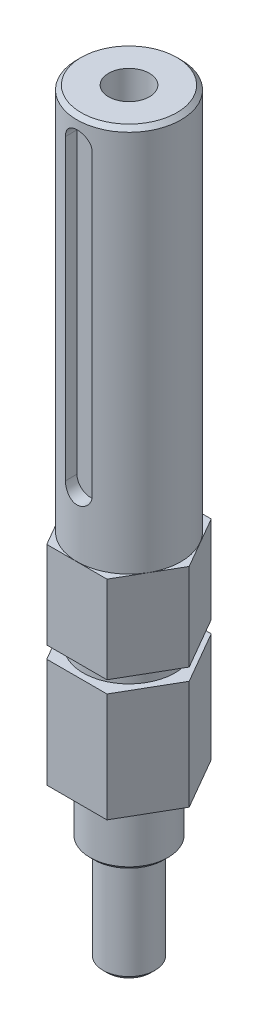
ISO-10303-21;
HEADER;
FILE_DESCRIPTION(('STEP AP214'),'2;1');
FILE_NAME('part.step','',(''),(''),'','','');
FILE_SCHEMA(('AUTOMOTIVE_DESIGN { 1 0 10303 214 1 1 1 1 }'));
ENDSEC;
DATA;
#1=APPLICATION_CONTEXT('core data for automotive mechanical design processes');
#2=APPLICATION_PROTOCOL_DEFINITION('international standard','automotive_design',2000,#1);
#3=PRODUCT_CONTEXT('',#1,'mechanical');
#4=PRODUCT('Part','Part','',(#3));
#5=PRODUCT_RELATED_PRODUCT_CATEGORY('part','',(#4));
#6=PRODUCT_DEFINITION_FORMATION('','',#4);
#7=PRODUCT_DEFINITION_CONTEXT('part definition',#1,'design');
#8=PRODUCT_DEFINITION('design','',#6,#7);
#9=PRODUCT_DEFINITION_SHAPE('','',#8);
#10=(LENGTH_UNIT() NAMED_UNIT(*) SI_UNIT(.MILLI.,.METRE.));
#11=(NAMED_UNIT(*) PLANE_ANGLE_UNIT() SI_UNIT($,.RADIAN.));
#12=(NAMED_UNIT(*) SI_UNIT($,.STERADIAN.) SOLID_ANGLE_UNIT());
#13=UNCERTAINTY_MEASURE_WITH_UNIT(LENGTH_MEASURE(1.E-05),#10,'distance_accuracy_value','');
#14=(GEOMETRIC_REPRESENTATION_CONTEXT(3) GLOBAL_UNCERTAINTY_ASSIGNED_CONTEXT((#13)) GLOBAL_UNIT_ASSIGNED_CONTEXT((#10,
#11,#12)) REPRESENTATION_CONTEXT('',''));
#15=CARTESIAN_POINT('',(0.,0.,0.));
#16=DIRECTION('',(0.,0.,1.));
#17=DIRECTION('',(1.,0.,0.));
#18=AXIS2_PLACEMENT_3D('',#15,#16,#17);
#19=CARTESIAN_POINT('',(-35.1448337161431,-45.212,-16.669011646302));
#20=DIRECTION('',(0.,-1.,0.));
#21=DIRECTION('',(0.,0.,-1.));
#22=AXIS2_PLACEMENT_3D('',#19,#20,#21);
#23=PLANE('',#22);
#24=CARTESIAN_POINT('',(-38.3071337161431,-45.2119999999923,-16.669011646302));
#25=DIRECTION('',(0.,1.,0.));
#26=DIRECTION('',(0.,0.,1.));
#27=AXIS2_PLACEMENT_3D('',#24,#25,#26);
#28=CIRCLE('',#27,2.65430000003345);
#29=CARTESIAN_POINT('',(-38.3071337161431,-45.2119999999923,-14.0147116462686));
#30=VERTEX_POINT('',#29);
#31=EDGE_CURVE('E19',#30,#30,#28,.T.);
#32=ORIENTED_EDGE('',*,*,#31,.F.);
#33=EDGE_LOOP('',(#32));
#34=FACE_BOUND('',#33,.T.);
#35=ADVANCED_FACE('F16',(#34),#23,.T.);
#36=CARTESIAN_POINT('',(-38.3071337161431,-44.704000000138,-16.669011646302));
#37=DIRECTION('',(0.,1.,0.));
#38=DIRECTION('',(0.,0.,1.));
#39=AXIS2_PLACEMENT_3D('',#36,#37,#38);
#40=CONICAL_SURFACE('',#39,3.16229999994458,0.785398163453397);
#41=ORIENTED_EDGE('',*,*,#31,.T.);
#42=EDGE_LOOP('',(#41));
#43=FACE_BOUND('',#42,.T.);
#44=CARTESIAN_POINT('',(-38.3071337161431,-44.704,-16.669011646302));
#45=DIRECTION('',(0.,1.,0.));
#46=DIRECTION('',(0.,0.,1.));
#47=AXIS2_PLACEMENT_3D('',#44,#45,#46);
#48=CIRCLE('',#47,3.1623);
#49=CARTESIAN_POINT('',(-38.3071337161431,-44.704,-13.506711646302));
#50=VERTEX_POINT('',#49);
#51=EDGE_CURVE('E175',#50,#50,#48,.T.);
#52=ORIENTED_EDGE('',*,*,#51,.F.);
#53=EDGE_LOOP('',(#52));
#54=FACE_BOUND('',#53,.T.);
#55=ADVANCED_FACE('F375',(#43,#54),#40,.T.);
#56=CARTESIAN_POINT('',(-38.3071337161431,-45.212,-16.669011646302));
#57=DIRECTION('',(0.,1.,0.));
#58=DIRECTION('',(0.,0.,1.));
#59=AXIS2_PLACEMENT_3D('',#56,#57,#58);
#60=CYLINDRICAL_SURFACE('',#59,3.1623);
#61=ORIENTED_EDGE('',*,*,#51,.T.);
#62=EDGE_LOOP('',(#61));
#63=FACE_BOUND('',#62,.T.);
#64=CARTESIAN_POINT('',(-38.3071337161431,-32.512,-16.669011646302));
#65=DIRECTION('',(0.,1.,0.));
#66=DIRECTION('',(0.,0.,1.));
#67=AXIS2_PLACEMENT_3D('',#64,#65,#66);
#68=CIRCLE('',#67,3.1623);
#69=CARTESIAN_POINT('',(-38.3071337161431,-32.512,-13.506711646302));
#70=VERTEX_POINT('',#69);
#71=EDGE_CURVE('E177',#70,#70,#68,.T.);
#72=ORIENTED_EDGE('',*,*,#71,.F.);
#73=EDGE_LOOP('',(#72));
#74=FACE_BOUND('',#73,.T.);
#75=ADVANCED_FACE('F372',(#63,#74),#60,.T.);
#76=CARTESIAN_POINT('',(-33.5573337161431,-32.512,-16.669011646302));
#77=DIRECTION('',(0.,-1.,0.));
#78=DIRECTION('',(0.,0.,-1.));
#79=AXIS2_PLACEMENT_3D('',#76,#77,#78);
#80=PLANE('',#79);
#81=ORIENTED_EDGE('',*,*,#71,.T.);
#82=EDGE_LOOP('',(#81));
#83=FACE_BOUND('',#82,.T.);
#84=CARTESIAN_POINT('',(-38.3071337161431,-32.5119999999401,-16.669011646302));
#85=DIRECTION('',(0.,1.,0.));
#86=DIRECTION('',(0.,0.,1.));
#87=AXIS2_PLACEMENT_3D('',#84,#85,#86);
#88=CIRCLE('',#87,4.24180000006128);
#89=CARTESIAN_POINT('',(-38.3071337161431,-32.5119999999401,-12.4272116462407));
#90=VERTEX_POINT('',#89);
#91=EDGE_CURVE('E174',#90,#90,#88,.T.);
#92=ORIENTED_EDGE('',*,*,#91,.F.);
#93=EDGE_LOOP('',(#92));
#94=FACE_BOUND('',#93,.T.);
#95=ADVANCED_FACE('F368',(#83,#94),#80,.T.);
#96=CARTESIAN_POINT('',(-38.3071337161431,-32.0040000000859,-16.669011646302));
#97=DIRECTION('',(0.,1.,0.));
#98=DIRECTION('',(0.,0.,1.));
#99=AXIS2_PLACEMENT_3D('',#96,#97,#98);
#100=CONICAL_SURFACE('',#99,4.74979999991557,0.785398163397448);
#101=CARTESIAN_POINT('',(-38.3071337161431,-32.004,-16.669011646302));
#102=DIRECTION('',(0.,1.,0.));
#103=DIRECTION('',(0.,0.,1.));
#104=AXIS2_PLACEMENT_3D('',#101,#102,#103);
#105=CIRCLE('',#104,4.7498);
#106=CARTESIAN_POINT('',(-38.3071337161431,-32.004,-11.919211646302));
#107=VERTEX_POINT('',#106);
#108=EDGE_CURVE('E171',#107,#107,#105,.T.);
#109=ORIENTED_EDGE('',*,*,#108,.F.);
#110=EDGE_LOOP('',(#109));
#111=FACE_BOUND('',#110,.T.);
#112=ORIENTED_EDGE('',*,*,#91,.T.);
#113=EDGE_LOOP('',(#112));
#114=FACE_BOUND('',#113,.T.);
#115=ADVANCED_FACE('F364',(#111,#114),#100,.T.);
#116=CARTESIAN_POINT('',(-38.3071337161431,-45.212,-16.669011646302));
#117=DIRECTION('',(0.,1.,0.));
#118=DIRECTION('',(0.,0.,1.));
#119=AXIS2_PLACEMENT_3D('',#116,#117,#118);
#120=CYLINDRICAL_SURFACE('',#119,4.7498);
#121=CARTESIAN_POINT('',(-38.3071337161431,-25.4,-16.669011646302));
#122=DIRECTION('',(0.,1.,0.));
#123=DIRECTION('',(0.,0.,1.));
#124=AXIS2_PLACEMENT_3D('',#121,#122,#123);
#125=CIRCLE('',#124,4.7498);
#126=CARTESIAN_POINT('',(-38.3071337161431,-25.4,-11.919211646302));
#127=VERTEX_POINT('',#126);
#128=EDGE_CURVE('E153',#127,#127,#125,.T.);
#129=ORIENTED_EDGE('',*,*,#128,.F.);
#130=EDGE_LOOP('',(#129));
#131=FACE_BOUND('',#130,.T.);
#132=ORIENTED_EDGE('',*,*,#108,.T.);
#133=EDGE_LOOP('',(#132));
#134=FACE_BOUND('',#133,.T.);
#135=ADVANCED_FACE('F361',(#131,#134),#120,.T.);
#136=CARTESIAN_POINT('',(-41.9733079254973,-25.4,-10.319011646302));
#137=DIRECTION('',(0.,-1.,0.));
#138=DIRECTION('',(0.,0.,-1.));
#139=AXIS2_PLACEMENT_3D('',#136,#137,#138);
#140=PLANE('',#139);
#141=DIRECTION('',(-0.5,0.,-0.866025403784439));
#142=VECTOR('',#141,1.);
#143=CARTESIAN_POINT('',(-34.640959506789,-25.4,-23.019011646302));
#144=LINE('',#143,#142);
#145=CARTESIAN_POINT('',(-30.9747852974349,-25.4,-16.669011646302));
#146=VERTEX_POINT('',#145);
#147=CARTESIAN_POINT('',(-34.640959506789,-25.4,-23.019011646302));
#148=VERTEX_POINT('',#147);
#149=EDGE_CURVE('E313',#146,#148,#144,.T.);
#150=ORIENTED_EDGE('',*,*,#149,.F.);
#151=DIRECTION('',(0.500000000000001,0.,-0.866025403784438));
#152=VECTOR('',#151,1.);
#153=CARTESIAN_POINT('',(-30.9747852974349,-25.4,-16.669011646302));
#154=LINE('',#153,#152);
#155=CARTESIAN_POINT('',(-34.640959506789,-25.4,-10.319011646302));
#156=VERTEX_POINT('',#155);
#157=EDGE_CURVE('E307',#156,#146,#154,.T.);
#158=ORIENTED_EDGE('',*,*,#157,.F.);
#159=DIRECTION('',(1.,0.,0.));
#160=VECTOR('',#159,1.);
#161=CARTESIAN_POINT('',(-34.640959506789,-25.4,-10.319011646302));
#162=LINE('',#161,#160);
#163=CARTESIAN_POINT('',(-41.9733079254973,-25.4,-10.319011646302));
#164=VERTEX_POINT('',#163);
#165=EDGE_CURVE('E150',#164,#156,#162,.T.);
#166=ORIENTED_EDGE('',*,*,#165,.F.);
#167=DIRECTION('',(0.5,0.,0.866025403784439));
#168=VECTOR('',#167,1.);
#169=CARTESIAN_POINT('',(-41.9733079254973,-25.4,-10.319011646302));
#170=LINE('',#169,#168);
#171=CARTESIAN_POINT('',(-45.6394821348514,-25.4,-16.669011646302));
#172=VERTEX_POINT('',#171);
#173=EDGE_CURVE('E145',#172,#164,#170,.T.);
#174=ORIENTED_EDGE('',*,*,#173,.F.);
#175=DIRECTION('',(-0.5,0.,0.866025403784439));
#176=VECTOR('',#175,1.);
#177=CARTESIAN_POINT('',(-45.6394821348514,-25.4,-16.669011646302));
#178=LINE('',#177,#176);
#179=CARTESIAN_POINT('',(-41.9733079254973,-25.4,-23.019011646302));
#180=VERTEX_POINT('',#179);
#181=EDGE_CURVE('E142',#180,#172,#178,.T.);
#182=ORIENTED_EDGE('',*,*,#181,.F.);
#183=DIRECTION('',(-1.,0.,0.));
#184=VECTOR('',#183,1.);
#185=CARTESIAN_POINT('',(-41.9733079254973,-25.4,-23.019011646302));
#186=LINE('',#185,#184);
#187=EDGE_CURVE('E162',#148,#180,#186,.T.);
#188=ORIENTED_EDGE('',*,*,#187,.F.);
#189=EDGE_LOOP('',(#150,#158,#166,#174,#182,#188));
#190=FACE_BOUND('',#189,.T.);
#191=ORIENTED_EDGE('',*,*,#128,.T.);
#192=EDGE_LOOP('',(#191));
#193=FACE_BOUND('',#192,.T.);
#194=ADVANCED_FACE('F147',(#190,#193),#140,.T.);
#195=CARTESIAN_POINT('',(-41.9733079254973,-12.1158,-10.319011646302));
#196=DIRECTION('',(-0.866025403784439,0.,0.5));
#197=DIRECTION('',(0.5,0.,0.866025403784439));
#198=AXIS2_PLACEMENT_3D('',#195,#196,#197);
#199=PLANE('',#198);
#200=DIRECTION('',(-0.5,0.,-0.866025403784438));
#201=VECTOR('',#200,1.);
#202=CARTESIAN_POINT('',(-41.9733079254973,-12.1158,-10.319011646302));
#203=LINE('',#202,#201);
#204=CARTESIAN_POINT('',(-41.9733079254973,-12.1158,-10.319011646302));
#205=VERTEX_POINT('',#204);
#206=CARTESIAN_POINT('',(-45.6394821348514,-12.1158,-16.669011646302));
#207=VERTEX_POINT('',#206);
#208=EDGE_CURVE('E159',#205,#207,#203,.T.);
#209=ORIENTED_EDGE('',*,*,#208,.T.);
#210=DIRECTION('',(0.,1.,0.));
#211=VECTOR('',#210,1.);
#212=CARTESIAN_POINT('',(-45.6394821348514,-12.1158,-16.669011646302));
#213=LINE('',#212,#211);
#214=EDGE_CURVE('E156',#172,#207,#213,.T.);
#215=ORIENTED_EDGE('',*,*,#214,.F.);
#216=ORIENTED_EDGE('',*,*,#173,.T.);
#217=DIRECTION('',(0.,1.,0.));
#218=VECTOR('',#217,1.);
#219=CARTESIAN_POINT('',(-41.9733079254973,-12.1158,-10.319011646302));
#220=LINE('',#219,#218);
#221=EDGE_CURVE('E298',#205,#164,#220,.F.);
#222=ORIENTED_EDGE('',*,*,#221,.F.);
#223=EDGE_LOOP('',(#209,#215,#216,#222));
#224=FACE_BOUND('',#223,.T.);
#225=ADVANCED_FACE('F157',(#224),#199,.T.);
#226=CARTESIAN_POINT('',(-45.6394821348514,-12.1158,-16.669011646302));
#227=DIRECTION('',(-0.866025403784439,0.,-0.5));
#228=DIRECTION('',(-0.5,0.,0.866025403784439));
#229=AXIS2_PLACEMENT_3D('',#226,#227,#228);
#230=PLANE('',#229);
#231=DIRECTION('',(0.5,0.,-0.866025403784438));
#232=VECTOR('',#231,1.);
#233=CARTESIAN_POINT('',(-45.6394821348514,-12.1158,-16.669011646302));
#234=LINE('',#233,#232);
#235=CARTESIAN_POINT('',(-41.9733079254973,-12.1158,-23.019011646302));
#236=VERTEX_POINT('',#235);
#237=EDGE_CURVE('E295',#207,#236,#234,.T.);
#238=ORIENTED_EDGE('',*,*,#237,.T.);
#239=DIRECTION('',(0.,1.,0.));
#240=VECTOR('',#239,1.);
#241=CARTESIAN_POINT('',(-41.9733079254973,-12.1158,-23.019011646302));
#242=LINE('',#241,#240);
#243=EDGE_CURVE('E166',#180,#236,#242,.T.);
#244=ORIENTED_EDGE('',*,*,#243,.F.);
#245=ORIENTED_EDGE('',*,*,#181,.T.);
#246=ORIENTED_EDGE('',*,*,#214,.T.);
#247=EDGE_LOOP('',(#238,#244,#245,#246));
#248=FACE_BOUND('',#247,.T.);
#249=ADVANCED_FACE('F164',(#248),#230,.T.);
#250=CARTESIAN_POINT('',(-41.9733079254973,-12.1158,-23.019011646302));
#251=DIRECTION('',(0.,0.,-1.));
#252=DIRECTION('',(-1.,0.,0.));
#253=AXIS2_PLACEMENT_3D('',#250,#251,#252);
#254=PLANE('',#253);
#255=DIRECTION('',(1.,0.,0.));
#256=VECTOR('',#255,1.);
#257=CARTESIAN_POINT('',(-41.9733079254973,-12.1158,-23.019011646302));
#258=LINE('',#257,#256);
#259=CARTESIAN_POINT('',(-34.640959506789,-12.1158,-23.019011646302));
#260=VERTEX_POINT('',#259);
#261=EDGE_CURVE('E293',#236,#260,#258,.T.);
#262=ORIENTED_EDGE('',*,*,#261,.T.);
#263=DIRECTION('',(0.,1.,0.));
#264=VECTOR('',#263,1.);
#265=CARTESIAN_POINT('',(-34.640959506789,-12.1158,-23.019011646302));
#266=LINE('',#265,#264);
#267=EDGE_CURVE('E310',#148,#260,#266,.T.);
#268=ORIENTED_EDGE('',*,*,#267,.F.);
#269=ORIENTED_EDGE('',*,*,#187,.T.);
#270=ORIENTED_EDGE('',*,*,#243,.T.);
#271=EDGE_LOOP('',(#262,#268,#269,#270));
#272=FACE_BOUND('',#271,.T.);
#273=ADVANCED_FACE('F318',(#272),#254,.T.);
#274=CARTESIAN_POINT('',(-34.640959506789,-12.1158,-23.019011646302));
#275=DIRECTION('',(0.866025403784439,0.,-0.5));
#276=DIRECTION('',(-0.5,0.,-0.866025403784439));
#277=AXIS2_PLACEMENT_3D('',#274,#275,#276);
#278=PLANE('',#277);
#279=DIRECTION('',(0.5,0.,0.866025403784438));
#280=VECTOR('',#279,1.);
#281=CARTESIAN_POINT('',(-34.640959506789,-12.1158,-23.019011646302));
#282=LINE('',#281,#280);
#283=CARTESIAN_POINT('',(-30.9747852974349,-12.1158,-16.669011646302));
#284=VERTEX_POINT('',#283);
#285=EDGE_CURVE('E291',#260,#284,#282,.T.);
#286=ORIENTED_EDGE('',*,*,#285,.T.);
#287=DIRECTION('',(0.,1.,0.));
#288=VECTOR('',#287,1.);
#289=CARTESIAN_POINT('',(-30.9747852974349,-12.1158,-16.669011646302));
#290=LINE('',#289,#288);
#291=EDGE_CURVE('E304',#146,#284,#290,.T.);
#292=ORIENTED_EDGE('',*,*,#291,.F.);
#293=ORIENTED_EDGE('',*,*,#149,.T.);
#294=ORIENTED_EDGE('',*,*,#267,.T.);
#295=EDGE_LOOP('',(#286,#292,#293,#294));
#296=FACE_BOUND('',#295,.T.);
#297=ADVANCED_FACE('F323',(#296),#278,.T.);
#298=CARTESIAN_POINT('',(-30.9747852974349,-12.1158,-16.669011646302));
#299=DIRECTION('',(0.866025403784438,0.,0.500000000000001));
#300=DIRECTION('',(0.500000000000001,0.,-0.866025403784438));
#301=AXIS2_PLACEMENT_3D('',#298,#299,#300);
#302=PLANE('',#301);
#303=DIRECTION('',(-0.500000000000001,0.,0.866025403784438));
#304=VECTOR('',#303,1.);
#305=CARTESIAN_POINT('',(-30.9747852974349,-12.1158,-16.669011646302));
#306=LINE('',#305,#304);
#307=CARTESIAN_POINT('',(-34.640959506789,-12.1158,-10.319011646302));
#308=VERTEX_POINT('',#307);
#309=EDGE_CURVE('E289',#284,#308,#306,.T.);
#310=ORIENTED_EDGE('',*,*,#309,.T.);
#311=DIRECTION('',(0.,1.,0.));
#312=VECTOR('',#311,1.);
#313=CARTESIAN_POINT('',(-34.640959506789,-12.1158,-10.319011646302));
#314=LINE('',#313,#312);
#315=EDGE_CURVE('E300',#156,#308,#314,.T.);
#316=ORIENTED_EDGE('',*,*,#315,.F.);
#317=ORIENTED_EDGE('',*,*,#157,.T.);
#318=ORIENTED_EDGE('',*,*,#291,.T.);
#319=EDGE_LOOP('',(#310,#316,#317,#318));
#320=FACE_BOUND('',#319,.T.);
#321=ADVANCED_FACE('F327',(#320),#302,.T.);
#322=CARTESIAN_POINT('',(-34.640959506789,-12.1158,-10.319011646302));
#323=DIRECTION('',(0.,0.,1.));
#324=DIRECTION('',(1.,0.,0.));
#325=AXIS2_PLACEMENT_3D('',#322,#323,#324);
#326=PLANE('',#325);
#327=DIRECTION('',(1.,0.,0.));
#328=VECTOR('',#327,1.);
#329=CARTESIAN_POINT('',(-41.9733079254973,-12.1158,-10.319011646302));
#330=LINE('',#329,#328);
#331=EDGE_CURVE('E286',#308,#205,#330,.F.);
#332=ORIENTED_EDGE('',*,*,#331,.T.);
#333=ORIENTED_EDGE('',*,*,#221,.T.);
#334=ORIENTED_EDGE('',*,*,#165,.T.);
#335=ORIENTED_EDGE('',*,*,#315,.T.);
#336=EDGE_LOOP('',(#332,#333,#334,#335));
#337=FACE_BOUND('',#336,.T.);
#338=ADVANCED_FACE('F330',(#337),#326,.T.);
#339=CARTESIAN_POINT('',(-41.9733079254973,-12.1158,-10.319011646302));
#340=DIRECTION('',(0.,-1.,0.));
#341=DIRECTION('',(0.,0.,-1.));
#342=AXIS2_PLACEMENT_3D('',#339,#340,#341);
#343=PLANE('',#342);
#344=CARTESIAN_POINT('',(-38.3071337161431,-12.1158,-16.669011646302));
#345=DIRECTION('',(0.,-1.,0.));
#346=DIRECTION('',(0.,0.,-1.));
#347=AXIS2_PLACEMENT_3D('',#344,#345,#346);
#348=CIRCLE('',#347,5.58800000000003);
#349=CARTESIAN_POINT('',(-38.3071337161431,-12.1158,-22.257011646302));
#350=VERTEX_POINT('',#349);
#351=EDGE_CURVE('E285',#350,#350,#348,.F.);
#352=ORIENTED_EDGE('',*,*,#351,.F.);
#353=EDGE_LOOP('',(#352));
#354=FACE_BOUND('',#353,.T.);
#355=ORIENTED_EDGE('',*,*,#309,.F.);
#356=ORIENTED_EDGE('',*,*,#285,.F.);
#357=ORIENTED_EDGE('',*,*,#261,.F.);
#358=ORIENTED_EDGE('',*,*,#237,.F.);
#359=ORIENTED_EDGE('',*,*,#208,.F.);
#360=ORIENTED_EDGE('',*,*,#331,.F.);
#361=EDGE_LOOP('',(#355,#356,#357,#358,#359,#360));
#362=FACE_BOUND('',#361,.T.);
#363=ADVANCED_FACE('F332',(#354,#362),#343,.F.);
#364=CARTESIAN_POINT('',(-38.3071337161431,31.2419999999999,-16.669011646302));
#365=DIRECTION('',(0.,1.,0.));
#366=DIRECTION('',(0.,0.,1.));
#367=AXIS2_PLACEMENT_3D('',#364,#365,#366);
#368=CONICAL_SURFACE('',#367,2.48793000000006,1.0297442586766);
#369=CARTESIAN_POINT('',(-38.3071337161431,29.7471008401027,-16.6690116463016));
#370=VERTEX_POINT('',#369);
#371=VERTEX_LOOP('',#370);
#372=FACE_BOUND('',#371,.T.);
#373=CARTESIAN_POINT('',(-38.3071337161431,31.242,-16.669011646302));
#374=DIRECTION('',(0.,-1.,0.));
#375=DIRECTION('',(0.,0.,-1.));
#376=AXIS2_PLACEMENT_3D('',#373,#374,#375);
#377=CIRCLE('',#376,2.48793);
#378=CARTESIAN_POINT('',(-38.3071337161431,31.242,-19.156941646302));
#379=VERTEX_POINT('',#378);
#380=EDGE_CURVE('E281',#379,#379,#377,.F.);
#381=ORIENTED_EDGE('',*,*,#380,.T.);
#382=EDGE_LOOP('',(#381));
#383=FACE_BOUND('',#382,.T.);
#384=ADVANCED_FACE('F334',(#372,#383),#368,.F.);
#385=CARTESIAN_POINT('',(-38.3071337161431,-10.6172,-16.669011646302));
#386=DIRECTION('',(0.,-1.,0.));
#387=DIRECTION('',(0.,0.,-1.));
#388=AXIS2_PLACEMENT_3D('',#385,#386,#387);
#389=CYLINDRICAL_SURFACE('',#388,5.58800000000003);
#390=ORIENTED_EDGE('',*,*,#351,.T.);
#391=EDGE_LOOP('',(#390));
#392=FACE_BOUND('',#391,.T.);
#393=CARTESIAN_POINT('',(-38.3071337161431,-10.6172,-16.669011646302));
#394=DIRECTION('',(0.,-1.,0.));
#395=DIRECTION('',(0.,0.,-1.));
#396=AXIS2_PLACEMENT_3D('',#393,#394,#395);
#397=CIRCLE('',#396,5.58800000000003);
#398=CARTESIAN_POINT('',(-38.3071337161431,-10.6172,-22.257011646302));
#399=VERTEX_POINT('',#398);
#400=EDGE_CURVE('E284',#399,#399,#397,.F.);
#401=ORIENTED_EDGE('',*,*,#400,.F.);
#402=EDGE_LOOP('',(#401));
#403=FACE_BOUND('',#402,.T.);
#404=ADVANCED_FACE('F342',(#392,#403),#389,.T.);
#405=CARTESIAN_POINT('',(-38.3071337161431,47.117,-16.669011646302));
#406=DIRECTION('',(0.,-1.,0.));
#407=DIRECTION('',(0.,0.,-1.));
#408=AXIS2_PLACEMENT_3D('',#405,#406,#407);
#409=CYLINDRICAL_SURFACE('',#408,2.48793);
#410=ORIENTED_EDGE('',*,*,#380,.F.);
#411=EDGE_LOOP('',(#410));
#412=FACE_BOUND('',#411,.T.);
#413=CARTESIAN_POINT('',(-38.3071337161431,47.117,-16.669011646302));
#414=DIRECTION('',(0.,-1.,0.));
#415=DIRECTION('',(0.,0.,-1.));
#416=AXIS2_PLACEMENT_3D('',#413,#414,#415);
#417=CIRCLE('',#416,2.48793);
#418=CARTESIAN_POINT('',(-38.3071337161431,47.117,-19.156941646302));
#419=VERTEX_POINT('',#418);
#420=EDGE_CURVE('E280',#419,#419,#417,.T.);
#421=ORIENTED_EDGE('',*,*,#420,.F.);
#422=EDGE_LOOP('',(#421));
#423=FACE_BOUND('',#422,.T.);
#424=ADVANCED_FACE('F462',(#412,#423),#409,.F.);
#425=CARTESIAN_POINT('',(-41.9733079254973,-10.6172,-10.319011646302));
#426=DIRECTION('',(0.,-1.,0.));
#427=DIRECTION('',(0.,0.,-1.));
#428=AXIS2_PLACEMENT_3D('',#425,#426,#427);
#429=PLANE('',#428);
#430=ORIENTED_EDGE('',*,*,#400,.T.);
#431=EDGE_LOOP('',(#430));
#432=FACE_BOUND('',#431,.T.);
#433=DIRECTION('',(-0.5,0.,-0.866025403784438));
#434=VECTOR('',#433,1.);
#435=CARTESIAN_POINT('',(-34.640959506789,-10.6172,-23.019011646302));
#436=LINE('',#435,#434);
#437=CARTESIAN_POINT('',(-30.9747852974349,-10.6172,-16.669011646302));
#438=VERTEX_POINT('',#437);
#439=CARTESIAN_POINT('',(-34.640959506789,-10.6172,-23.019011646302));
#440=VERTEX_POINT('',#439);
#441=EDGE_CURVE('E262',#438,#440,#436,.T.);
#442=ORIENTED_EDGE('',*,*,#441,.F.);
#443=DIRECTION('',(0.500000000000001,0.,-0.866025403784438));
#444=VECTOR('',#443,1.);
#445=CARTESIAN_POINT('',(-30.9747852974349,-10.6172,-16.669011646302));
#446=LINE('',#445,#444);
#447=CARTESIAN_POINT('',(-34.640959506789,-10.6172,-10.319011646302));
#448=VERTEX_POINT('',#447);
#449=EDGE_CURVE('E256',#448,#438,#446,.T.);
#450=ORIENTED_EDGE('',*,*,#449,.F.);
#451=DIRECTION('',(1.,0.,0.));
#452=VECTOR('',#451,1.);
#453=CARTESIAN_POINT('',(-34.640959506789,-10.6172,-10.319011646302));
#454=LINE('',#453,#452);
#455=CARTESIAN_POINT('',(-41.9733079254973,-10.6172,-10.319011646302));
#456=VERTEX_POINT('',#455);
#457=EDGE_CURVE('E251',#456,#448,#454,.T.);
#458=ORIENTED_EDGE('',*,*,#457,.F.);
#459=DIRECTION('',(0.5,0.,0.866025403784439));
#460=VECTOR('',#459,1.);
#461=CARTESIAN_POINT('',(-41.9733079254973,-10.6172,-10.319011646302));
#462=LINE('',#461,#460);
#463=CARTESIAN_POINT('',(-45.6394821348514,-10.6172,-16.669011646302));
#464=VERTEX_POINT('',#463);
#465=EDGE_CURVE('E277',#464,#456,#462,.T.);
#466=ORIENTED_EDGE('',*,*,#465,.F.);
#467=DIRECTION('',(-0.5,0.,0.866025403784438));
#468=VECTOR('',#467,1.);
#469=CARTESIAN_POINT('',(-45.6394821348514,-10.6172,-16.669011646302));
#470=LINE('',#469,#468);
#471=CARTESIAN_POINT('',(-41.9733079254973,-10.6172,-23.019011646302));
#472=VERTEX_POINT('',#471);
#473=EDGE_CURVE('E274',#472,#464,#470,.T.);
#474=ORIENTED_EDGE('',*,*,#473,.F.);
#475=DIRECTION('',(-1.,0.,0.));
#476=VECTOR('',#475,1.);
#477=CARTESIAN_POINT('',(-41.9733079254973,-10.6172,-23.019011646302));
#478=LINE('',#477,#476);
#479=EDGE_CURVE('E268',#440,#472,#478,.T.);
#480=ORIENTED_EDGE('',*,*,#479,.F.);
#481=EDGE_LOOP('',(#442,#450,#458,#466,#474,#480));
#482=FACE_BOUND('',#481,.T.);
#483=ADVANCED_FACE('F458',(#432,#482),#429,.T.);
#484=CARTESIAN_POINT('',(-38.3071337161431,47.117,-16.669011646302));
#485=DIRECTION('',(0.,1.,0.));
#486=DIRECTION('',(0.,0.,1.));
#487=AXIS2_PLACEMENT_3D('',#484,#485,#486);
#488=PLANE('',#487);
#489=ORIENTED_EDGE('',*,*,#420,.T.);
#490=EDGE_LOOP('',(#489));
#491=FACE_BOUND('',#490,.T.);
#492=CARTESIAN_POINT('',(-38.3071337161431,47.1170000000143,-16.669011646302));
#493=DIRECTION('',(0.,-1.,0.));
#494=DIRECTION('',(0.,0.,-1.));
#495=AXIS2_PLACEMENT_3D('',#492,#493,#494);
#496=CIRCLE('',#495,5.82929999994338);
#497=CARTESIAN_POINT('',(-38.3071337161431,47.1170000000143,-22.4983116462454));
#498=VERTEX_POINT('',#497);
#499=EDGE_CURVE('E238',#498,#498,#496,.T.);
#500=ORIENTED_EDGE('',*,*,#499,.F.);
#501=EDGE_LOOP('',(#500));
#502=FACE_BOUND('',#501,.T.);
#503=ADVANCED_FACE('F454',(#491,#502),#488,.T.);
#504=CARTESIAN_POINT('',(-41.9733079254973,0.,-10.319011646302));
#505=DIRECTION('',(-0.866025403784439,0.,0.5));
#506=DIRECTION('',(0.5,0.,0.866025403784439));
#507=AXIS2_PLACEMENT_3D('',#504,#505,#506);
#508=PLANE('',#507);
#509=DIRECTION('',(-0.5,0.,-0.866025403784438));
#510=VECTOR('',#509,1.);
#511=CARTESIAN_POINT('',(-41.9733079254973,0.,-10.319011646302));
#512=LINE('',#511,#510);
#513=CARTESIAN_POINT('',(-41.9733079254973,0.,-10.319011646302));
#514=VERTEX_POINT('',#513);
#515=CARTESIAN_POINT('',(-45.6394821348514,0.,-16.669011646302));
#516=VERTEX_POINT('',#515);
#517=EDGE_CURVE('E236',#514,#516,#512,.T.);
#518=ORIENTED_EDGE('',*,*,#517,.T.);
#519=DIRECTION('',(0.,1.,0.));
#520=VECTOR('',#519,1.);
#521=CARTESIAN_POINT('',(-45.6394821348514,0.,-16.669011646302));
#522=LINE('',#521,#520);
#523=EDGE_CURVE('E271',#464,#516,#522,.T.);
#524=ORIENTED_EDGE('',*,*,#523,.F.);
#525=ORIENTED_EDGE('',*,*,#465,.T.);
#526=DIRECTION('',(0.,1.,0.));
#527=VECTOR('',#526,1.);
#528=CARTESIAN_POINT('',(-41.9733079254973,0.,-10.319011646302));
#529=LINE('',#528,#527);
#530=EDGE_CURVE('E246',#514,#456,#529,.F.);
#531=ORIENTED_EDGE('',*,*,#530,.F.);
#532=EDGE_LOOP('',(#518,#524,#525,#531));
#533=FACE_BOUND('',#532,.T.);
#534=ADVANCED_FACE('F450',(#533),#508,.T.);
#535=CARTESIAN_POINT('',(-45.6394821348514,0.,-16.669011646302));
#536=DIRECTION('',(-0.866025403784438,0.,-0.5));
#537=DIRECTION('',(-0.5,0.,0.866025403784438));
#538=AXIS2_PLACEMENT_3D('',#535,#536,#537);
#539=PLANE('',#538);
#540=DIRECTION('',(0.5,0.,-0.866025403784438));
#541=VECTOR('',#540,1.);
#542=CARTESIAN_POINT('',(-45.6394821348514,0.,-16.669011646302));
#543=LINE('',#542,#541);
#544=CARTESIAN_POINT('',(-41.9733079254973,0.,-23.019011646302));
#545=VERTEX_POINT('',#544);
#546=EDGE_CURVE('E234',#516,#545,#543,.T.);
#547=ORIENTED_EDGE('',*,*,#546,.T.);
#548=DIRECTION('',(0.,1.,0.));
#549=VECTOR('',#548,1.);
#550=CARTESIAN_POINT('',(-41.9733079254973,0.,-23.019011646302));
#551=LINE('',#550,#549);
#552=EDGE_CURVE('E265',#472,#545,#551,.T.);
#553=ORIENTED_EDGE('',*,*,#552,.F.);
#554=ORIENTED_EDGE('',*,*,#473,.T.);
#555=ORIENTED_EDGE('',*,*,#523,.T.);
#556=EDGE_LOOP('',(#547,#553,#554,#555));
#557=FACE_BOUND('',#556,.T.);
#558=ADVANCED_FACE('F446',(#557),#539,.T.);
#559=CARTESIAN_POINT('',(-41.9733079254973,0.,-23.019011646302));
#560=DIRECTION('',(0.,0.,-1.));
#561=DIRECTION('',(-1.,0.,0.));
#562=AXIS2_PLACEMENT_3D('',#559,#560,#561);
#563=PLANE('',#562);
#564=DIRECTION('',(1.,0.,0.));
#565=VECTOR('',#564,1.);
#566=CARTESIAN_POINT('',(-41.9733079254973,0.,-23.019011646302));
#567=LINE('',#566,#565);
#568=CARTESIAN_POINT('',(-34.640959506789,0.,-23.019011646302));
#569=VERTEX_POINT('',#568);
#570=EDGE_CURVE('E232',#545,#569,#567,.T.);
#571=ORIENTED_EDGE('',*,*,#570,.T.);
#572=DIRECTION('',(0.,1.,0.));
#573=VECTOR('',#572,1.);
#574=CARTESIAN_POINT('',(-34.640959506789,0.,-23.019011646302));
#575=LINE('',#574,#573);
#576=EDGE_CURVE('E259',#440,#569,#575,.T.);
#577=ORIENTED_EDGE('',*,*,#576,.F.);
#578=ORIENTED_EDGE('',*,*,#479,.T.);
#579=ORIENTED_EDGE('',*,*,#552,.T.);
#580=EDGE_LOOP('',(#571,#577,#578,#579));
#581=FACE_BOUND('',#580,.T.);
#582=ADVANCED_FACE('F442',(#581),#563,.T.);
#583=CARTESIAN_POINT('',(-34.640959506789,0.,-23.019011646302));
#584=DIRECTION('',(0.866025403784438,0.,-0.5));
#585=DIRECTION('',(-0.5,0.,-0.866025403784438));
#586=AXIS2_PLACEMENT_3D('',#583,#584,#585);
#587=PLANE('',#586);
#588=DIRECTION('',(0.5,0.,0.866025403784438));
#589=VECTOR('',#588,1.);
#590=CARTESIAN_POINT('',(-34.640959506789,0.,-23.019011646302));
#591=LINE('',#590,#589);
#592=CARTESIAN_POINT('',(-30.9747852974349,0.,-16.669011646302));
#593=VERTEX_POINT('',#592);
#594=EDGE_CURVE('E230',#569,#593,#591,.T.);
#595=ORIENTED_EDGE('',*,*,#594,.T.);
#596=DIRECTION('',(0.,1.,0.));
#597=VECTOR('',#596,1.);
#598=CARTESIAN_POINT('',(-30.9747852974349,0.,-16.669011646302));
#599=LINE('',#598,#597);
#600=EDGE_CURVE('E254',#438,#593,#599,.T.);
#601=ORIENTED_EDGE('',*,*,#600,.F.);
#602=ORIENTED_EDGE('',*,*,#441,.T.);
#603=ORIENTED_EDGE('',*,*,#576,.T.);
#604=EDGE_LOOP('',(#595,#601,#602,#603));
#605=FACE_BOUND('',#604,.T.);
#606=ADVANCED_FACE('F439',(#605),#587,.T.);
#607=CARTESIAN_POINT('',(-30.9747852974349,0.,-16.669011646302));
#608=DIRECTION('',(0.866025403784438,0.,0.500000000000001));
#609=DIRECTION('',(0.500000000000001,0.,-0.866025403784438));
#610=AXIS2_PLACEMENT_3D('',#607,#608,#609);
#611=PLANE('',#610);
#612=DIRECTION('',(-0.500000000000001,0.,0.866025403784438));
#613=VECTOR('',#612,1.);
#614=CARTESIAN_POINT('',(-30.9747852974349,0.,-16.669011646302));
#615=LINE('',#614,#613);
#616=CARTESIAN_POINT('',(-34.640959506789,0.,-10.319011646302));
#617=VERTEX_POINT('',#616);
#618=EDGE_CURVE('E70',#593,#617,#615,.T.);
#619=ORIENTED_EDGE('',*,*,#618,.T.);
#620=DIRECTION('',(0.,1.,0.));
#621=VECTOR('',#620,1.);
#622=CARTESIAN_POINT('',(-34.640959506789,0.,-10.319011646302));
#623=LINE('',#622,#621);
#624=EDGE_CURVE('E249',#448,#617,#623,.T.);
#625=ORIENTED_EDGE('',*,*,#624,.F.);
#626=ORIENTED_EDGE('',*,*,#449,.T.);
#627=ORIENTED_EDGE('',*,*,#600,.T.);
#628=EDGE_LOOP('',(#619,#625,#626,#627));
#629=FACE_BOUND('',#628,.T.);
#630=ADVANCED_FACE('F435',(#629),#611,.T.);
#631=CARTESIAN_POINT('',(-34.640959506789,0.,-10.319011646302));
#632=DIRECTION('',(0.,0.,1.));
#633=DIRECTION('',(1.,0.,0.));
#634=AXIS2_PLACEMENT_3D('',#631,#632,#633);
#635=PLANE('',#634);
#636=DIRECTION('',(1.,0.,0.));
#637=VECTOR('',#636,1.);
#638=CARTESIAN_POINT('',(-41.9733079254973,0.,-10.319011646302));
#639=LINE('',#638,#637);
#640=EDGE_CURVE('E226',#617,#514,#639,.F.);
#641=ORIENTED_EDGE('',*,*,#640,.T.);
#642=ORIENTED_EDGE('',*,*,#530,.T.);
#643=ORIENTED_EDGE('',*,*,#457,.T.);
#644=ORIENTED_EDGE('',*,*,#624,.T.);
#645=EDGE_LOOP('',(#641,#642,#643,#644));
#646=FACE_BOUND('',#645,.T.);
#647=ADVANCED_FACE('F432',(#646),#635,.T.);
#648=CARTESIAN_POINT('',(-36.6688337161431,43.942,-9.912611646302));
#649=DIRECTION('',(1.,0.,0.));
#650=DIRECTION('',(0.,0.,-1.));
#651=AXIS2_PLACEMENT_3D('',#648,#649,#650);
#652=PLANE('',#651);
#653=DIRECTION('',(0.,1.,0.));
#654=VECTOR('',#653,1.);
#655=CARTESIAN_POINT('',(-36.6688337161431,7.62,-11.944611646302));
#656=LINE('',#655,#654);
#657=CARTESIAN_POINT('',(-36.6688337161431,43.942,-11.944611646302));
#658=VERTEX_POINT('',#657);
#659=CARTESIAN_POINT('',(-36.6688337161431,7.62,-11.944611646302));
#660=VERTEX_POINT('',#659);
#661=EDGE_CURVE('E241',#658,#660,#656,.F.);
#662=ORIENTED_EDGE('',*,*,#661,.T.);
#663=DIRECTION('',(0.,0.,-1.));
#664=VECTOR('',#663,1.);
#665=CARTESIAN_POINT('',(-36.6688337161431,7.62,-9.912611646302));
#666=LINE('',#665,#664);
#667=CARTESIAN_POINT('',(-36.6688337161431,7.62,-10.5471373908145));
#668=VERTEX_POINT('',#667);
#669=EDGE_CURVE('E58',#668,#660,#666,.T.);
#670=ORIENTED_EDGE('',*,*,#669,.F.);
#671=DIRECTION('',(0.,-1.,0.));
#672=VECTOR('',#671,1.);
#673=CARTESIAN_POINT('',(-36.6688337161431,47.117,-10.5471373908145));
#674=LINE('',#673,#672);
#675=CARTESIAN_POINT('',(-36.6688337161431,43.942,-10.5471373908145));
#676=VERTEX_POINT('',#675);
#677=EDGE_CURVE('E223',#676,#668,#674,.T.);
#678=ORIENTED_EDGE('',*,*,#677,.F.);
#679=DIRECTION('',(0.,0.,-1.));
#680=VECTOR('',#679,1.);
#681=CARTESIAN_POINT('',(-36.6688337161431,43.942,-9.912611646302));
#682=LINE('',#681,#680);
#683=EDGE_CURVE('E243',#658,#676,#682,.F.);
#684=ORIENTED_EDGE('',*,*,#683,.F.);
#685=EDGE_LOOP('',(#662,#670,#678,#684));
#686=FACE_BOUND('',#685,.T.);
#687=ADVANCED_FACE('F412',(#686),#652,.F.);
#688=CARTESIAN_POINT('',(-38.2944337161431,7.62,-11.944611646302));
#689=DIRECTION('',(0.,0.,-1.));
#690=DIRECTION('',(-1.,0.,0.));
#691=AXIS2_PLACEMENT_3D('',#688,#689,#690);
#692=PLANE('',#691);
#693=ORIENTED_EDGE('',*,*,#661,.F.);
#694=CARTESIAN_POINT('',(-38.2944337161431,43.942,-11.944611646302));
#695=DIRECTION('',(0.,0.,-1.));
#696=DIRECTION('',(-1.,0.,0.));
#697=AXIS2_PLACEMENT_3D('',#694,#695,#696);
#698=CIRCLE('',#697,1.6256);
#699=CARTESIAN_POINT('',(-39.9200337161431,43.942,-11.944611646302));
#700=VERTEX_POINT('',#699);
#701=EDGE_CURVE('E219',#658,#700,#698,.F.);
#702=ORIENTED_EDGE('',*,*,#701,.T.);
#703=DIRECTION('',(0.,1.,0.));
#704=VECTOR('',#703,1.);
#705=CARTESIAN_POINT('',(-39.9200337161431,7.62,-11.944611646302));
#706=LINE('',#705,#704);
#707=CARTESIAN_POINT('',(-39.9200337161431,7.62,-11.944611646302));
#708=VERTEX_POINT('',#707);
#709=EDGE_CURVE('E222',#700,#708,#706,.F.);
#710=ORIENTED_EDGE('',*,*,#709,.T.);
#711=CARTESIAN_POINT('',(-38.2944337161431,7.62,-11.944611646302));
#712=DIRECTION('',(0.,0.,-1.));
#713=DIRECTION('',(-1.,0.,0.));
#714=AXIS2_PLACEMENT_3D('',#711,#712,#713);
#715=CIRCLE('',#714,1.6256);
#716=EDGE_CURVE('E225',#708,#660,#715,.F.);
#717=ORIENTED_EDGE('',*,*,#716,.T.);
#718=EDGE_LOOP('',(#693,#702,#710,#717));
#719=FACE_BOUND('',#718,.T.);
#720=ADVANCED_FACE('F409',(#719),#692,.F.);
#721=CARTESIAN_POINT('',(-38.3071337161431,46.60900000016,-16.669011646302));
#722=DIRECTION('',(0.,-1.,0.));
#723=DIRECTION('',(0.,0.,-1.));
#724=AXIS2_PLACEMENT_3D('',#721,#722,#723);
#725=CONICAL_SURFACE('',#724,6.33729999985452,0.785398163453397);
#726=ORIENTED_EDGE('',*,*,#499,.T.);
#727=EDGE_LOOP('',(#726));
#728=FACE_BOUND('',#727,.T.);
#729=CARTESIAN_POINT('',(-38.3071337161431,46.609,-16.669011646302));
#730=DIRECTION('',(0.,-1.,0.));
#731=DIRECTION('',(0.,0.,-1.));
#732=AXIS2_PLACEMENT_3D('',#729,#730,#731);
#733=CIRCLE('',#732,6.3373);
#734=CARTESIAN_POINT('',(-38.3071337161431,46.609,-23.006311646302));
#735=VERTEX_POINT('',#734);
#736=EDGE_CURVE('E207',#735,#735,#733,.T.);
#737=ORIENTED_EDGE('',*,*,#736,.F.);
#738=EDGE_LOOP('',(#737));
#739=FACE_BOUND('',#738,.T.);
#740=ADVANCED_FACE('F420',(#728,#739),#725,.T.);
#741=CARTESIAN_POINT('',(-41.9733079254973,0.,-10.319011646302));
#742=DIRECTION('',(0.,-1.,0.));
#743=DIRECTION('',(0.,0.,-1.));
#744=AXIS2_PLACEMENT_3D('',#741,#742,#743);
#745=PLANE('',#744);
#746=CARTESIAN_POINT('',(-38.3071337161431,0.,-16.669011646302));
#747=DIRECTION('',(0.,-1.,0.));
#748=DIRECTION('',(0.,0.,-1.));
#749=AXIS2_PLACEMENT_3D('',#746,#747,#748);
#750=CIRCLE('',#749,6.3373);
#751=CARTESIAN_POINT('',(-38.3071337161431,0.,-23.006311646302));
#752=VERTEX_POINT('',#751);
#753=EDGE_CURVE('E211',#752,#752,#750,.F.);
#754=ORIENTED_EDGE('',*,*,#753,.F.);
#755=EDGE_LOOP('',(#754));
#756=FACE_BOUND('',#755,.T.);
#757=ORIENTED_EDGE('',*,*,#618,.F.);
#758=ORIENTED_EDGE('',*,*,#594,.F.);
#759=ORIENTED_EDGE('',*,*,#570,.F.);
#760=ORIENTED_EDGE('',*,*,#546,.F.);
#761=ORIENTED_EDGE('',*,*,#517,.F.);
#762=ORIENTED_EDGE('',*,*,#640,.F.);
#763=EDGE_LOOP('',(#757,#758,#759,#760,#761,#762));
#764=FACE_BOUND('',#763,.T.);
#765=ADVANCED_FACE('F415',(#756,#764),#745,.F.);
#766=CARTESIAN_POINT('',(-38.2944337161431,7.62,-9.912611646302));
#767=DIRECTION('',(0.,0.,-1.));
#768=DIRECTION('',(-1.,0.,0.));
#769=AXIS2_PLACEMENT_3D('',#766,#767,#768);
#770=CYLINDRICAL_SURFACE('',#769,1.6256);
#771=ORIENTED_EDGE('',*,*,#716,.F.);
#772=DIRECTION('',(0.,0.,1.));
#773=VECTOR('',#772,1.);
#774=CARTESIAN_POINT('',(-39.9200337161431,7.62,-9.912611646302));
#775=LINE('',#774,#773);
#776=CARTESIAN_POINT('',(-39.9200337161431,7.62,-10.5403963965086));
#777=VERTEX_POINT('',#776);
#778=EDGE_CURVE('E220',#708,#777,#775,.T.);
#779=ORIENTED_EDGE('',*,*,#778,.T.);
#780=CARTESIAN_POINT('',(-36.6688337161431,7.62,-10.5471373908145));
#781=CARTESIAN_POINT('',(-36.6688331100919,7.57508677691815,-10.5471405183145));
#782=CARTESIAN_POINT('',(-36.6706962456225,7.53019586174405,-10.5466386387906));
#783=CARTESIAN_POINT('',(-36.6781230803211,7.44075078269767,-10.5446571794989));
#784=CARTESIAN_POINT('',(-36.6836861261015,7.39619656077163,-10.5431777723583));
#785=CARTESIAN_POINT('',(-36.7058421837572,7.26371368533304,-10.5373329336803));
#786=CARTESIAN_POINT('',(-36.7279024890841,7.17669706632391,-10.5315605075661));
#787=CARTESIAN_POINT('',(-36.785881735209,7.00776292931235,-10.5169351684095));
#788=CARTESIAN_POINT('',(-36.8217990614285,6.92584481853792,-10.5080826142661));
#789=CARTESIAN_POINT('',(-36.9064250905725,6.76915632643435,-10.4882941374185));
#790=CARTESIAN_POINT('',(-36.9551372025294,6.6943878573029,-10.4773576596889));
#791=CARTESIAN_POINT('',(-37.0651738444627,6.55241795199924,-10.454341582249));
#792=CARTESIAN_POINT('',(-37.1267414214421,6.48540806038206,-10.442242821439));
#793=CARTESIAN_POINT('',(-37.2602380480791,6.36252362126526,-10.4184140226325));
#794=CARTESIAN_POINT('',(-37.3321706419867,6.30665289837255,-10.4066841124404));
#795=CARTESIAN_POINT('',(-37.4857159602333,6.20682360606488,-10.3846861467531));
#796=CARTESIAN_POINT('',(-37.5674620858195,6.16306427332973,-10.3744437254023));
#797=CARTESIAN_POINT('',(-37.737405204164,6.09002342307483,-10.3567974044013));
#798=CARTESIAN_POINT('',(-37.8255948309847,6.06072566201359,-10.3493903221486));
#799=CARTESIAN_POINT('',(-37.9796470409605,6.02381117685167,-10.339853051397));
#800=CARTESIAN_POINT('',(-38.0445631591427,6.01237015309669,-10.336815344419));
#801=CARTESIAN_POINT('',(-38.1753661998563,5.99743076045349,-10.3327438485359));
#802=CARTESIAN_POINT('',(-38.2412530994654,5.99393220432719,-10.3317100123911));
#803=CARTESIAN_POINT('',(-38.3968632175669,5.99515431763537,-10.3317138716911));
#804=CARTESIAN_POINT('',(-38.4865810638505,6.00330882807867,-10.3336369439403));
#805=CARTESIAN_POINT('',(-38.663343989902,6.0342677448791,-10.3411104648938));
#806=CARTESIAN_POINT('',(-38.7503866640296,6.05708495475224,-10.3466640838765));
#807=CARTESIAN_POINT('',(-38.9191932554944,6.11658792994094,-10.3607693286095));
#808=CARTESIAN_POINT('',(-39.000964289039,6.15325452069783,-10.3693168081565));
#809=CARTESIAN_POINT('',(-39.1571958551314,6.23935688193826,-10.3884886622239));
#810=CARTESIAN_POINT('',(-39.2316564266007,6.28879258443292,-10.3991130256857));
#811=CARTESIAN_POINT('',(-39.3727627398681,6.4001575115179,-10.4215310141825));
#812=CARTESIAN_POINT('',(-39.4392291626648,6.46231019578924,-10.433343302179));
#813=CARTESIAN_POINT('',(-39.5609193930067,6.59685859015687,-10.4566658343742));
#814=CARTESIAN_POINT('',(-39.6161412853098,6.66925604165564,-10.4681760268279));
#815=CARTESIAN_POINT('',(-39.7145841060054,6.823598183428,-10.4897688258281));
#816=CARTESIAN_POINT('',(-39.7576071014273,6.90567274298902,-10.4998267149717));
#817=CARTESIAN_POINT('',(-39.8291494786829,7.07616903153863,-10.5170848822691));
#818=CARTESIAN_POINT('',(-39.8576806206242,7.16458554732889,-10.5242874764431));
#819=CARTESIAN_POINT('',(-39.8922738483443,7.3146250794072,-10.5331412334675));
#820=CARTESIAN_POINT('',(-39.9026692116074,7.37522128041599,-10.535845550902));
#821=CARTESIAN_POINT('',(-39.9165523617936,7.49720076622725,-10.5394800705431));
#822=CARTESIAN_POINT('',(-39.9200458148164,7.558583363734,-10.5404117279857));
#823=CARTESIAN_POINT('',(-39.9200337161431,7.62,-10.5403963965086));
#824=B_SPLINE_CURVE_WITH_KNOTS('',3,(#780,#781,#782,#783,#784,#785,#786,#787,#788,#789,#790,
#791,#792,#793,#794,#795,#796,#797,#798,#799,#800,#801,#802,#803,#804,#805,#806,#807,#808,#809,
#810,#811,#812,#813,#814,#815,#816,#817,#818,#819,#820,#821,#822,#823),.UNSPECIFIED.,.F.,.F.,(4,
2,2,2,2,2,2,2,2,2,2,2,2,2,2,2,2,2,2,2,2,4),(0.,0.134654383447933,0.269284993845994,
0.537753454212696,0.806190642879928,1.07469942641418,1.34883846583001,1.62307146874411,
1.90157869837223,2.17977238690802,2.37724591457969,2.57471478690398,2.84366769526683,
3.11285577388,3.38167251787966,3.65048783059949,3.92451030634593,4.1985794164266,
4.47686962490249,4.75493363922742,4.93916434493798,5.12324374412577),.UNSPECIFIED.);
#825=EDGE_CURVE('E62',#668,#777,#824,.T.);
#826=ORIENTED_EDGE('',*,*,#825,.F.);
#827=ORIENTED_EDGE('',*,*,#669,.T.);
#828=EDGE_LOOP('',(#771,#779,#826,#827));
#829=FACE_BOUND('',#828,.T.);
#830=ADVANCED_FACE('F413',(#829),#770,.F.);
#831=CARTESIAN_POINT('',(-39.9200337161431,7.62,-9.912611646302));
#832=DIRECTION('',(-1.,0.,0.));
#833=DIRECTION('',(0.,0.,1.));
#834=AXIS2_PLACEMENT_3D('',#831,#832,#833);
#835=PLANE('',#834);
#836=ORIENTED_EDGE('',*,*,#709,.F.);
#837=DIRECTION('',(0.,0.,-1.));
#838=VECTOR('',#837,1.);
#839=CARTESIAN_POINT('',(-39.9200337161431,43.942,-9.912611646302));
#840=LINE('',#839,#838);
#841=CARTESIAN_POINT('',(-39.9200337161431,43.942,-10.5403963965086));
#842=VERTEX_POINT('',#841);
#843=EDGE_CURVE('E34',#700,#842,#840,.F.);
#844=ORIENTED_EDGE('',*,*,#843,.T.);
#845=DIRECTION('',(0.,-1.,0.));
#846=VECTOR('',#845,1.);
#847=CARTESIAN_POINT('',(-39.9200337161431,47.117,-10.5403963965086));
#848=LINE('',#847,#846);
#849=EDGE_CURVE('E25',#777,#842,#848,.F.);
#850=ORIENTED_EDGE('',*,*,#849,.F.);
#851=ORIENTED_EDGE('',*,*,#778,.F.);
#852=EDGE_LOOP('',(#836,#844,#850,#851));
#853=FACE_BOUND('',#852,.T.);
#854=ADVANCED_FACE('F202',(#853),#835,.F.);
#855=CARTESIAN_POINT('',(-38.2944337161431,43.942,-9.912611646302));
#856=DIRECTION('',(0.,0.,-1.));
#857=DIRECTION('',(-1.,0.,0.));
#858=AXIS2_PLACEMENT_3D('',#855,#856,#857);
#859=CYLINDRICAL_SURFACE('',#858,1.6256);
#860=ORIENTED_EDGE('',*,*,#701,.F.);
#861=ORIENTED_EDGE('',*,*,#683,.T.);
#862=CARTESIAN_POINT('',(-39.9200337161431,43.942,-10.5403963965086));
#863=CARTESIAN_POINT('',(-39.9200342954873,43.9869428359159,-10.540399511802));
#864=CARTESIAN_POINT('',(-39.9181687309837,44.0318633700861,-10.5399052654835));
#865=CARTESIAN_POINT('',(-39.9107320303684,44.1213678801322,-10.5379541732007));
#866=CARTESIAN_POINT('',(-39.9051615364027,44.1659519129771,-10.5364974940476));
#867=CARTESIAN_POINT('',(-39.8829747940316,44.2985276582255,-10.5307428767475));
#868=CARTESIAN_POINT('',(-39.8608829198913,44.3856073684634,-10.5250599890487));
#869=CARTESIAN_POINT('',(-39.8028156621007,44.5546666670796,-10.510668605993));
#870=CARTESIAN_POINT('',(-39.7668416487928,44.6366467579275,-10.5019604092806));
#871=CARTESIAN_POINT('',(-39.6820765816401,44.7934486049428,-10.4825111669367));
#872=CARTESIAN_POINT('',(-39.6332823519743,44.8682685811343,-10.471769617788));
#873=CARTESIAN_POINT('',(-39.5230890162478,45.0102810752113,-10.4492011383656));
#874=CARTESIAN_POINT('',(-39.4614535545177,45.0772873361893,-10.4373565656545));
#875=CARTESIAN_POINT('',(-39.3278117037203,45.2001517893574,-10.4140791379749));
#876=CARTESIAN_POINT('',(-39.2558014621105,45.2560058218457,-10.4026464379301));
#877=CARTESIAN_POINT('',(-39.1021695041442,45.3557360928586,-10.3812944795188));
#878=CARTESIAN_POINT('',(-39.020422043927,45.3994241594631,-10.371399943155));
#879=CARTESIAN_POINT('',(-38.8505070876062,45.4723206896669,-10.3544749748868));
#880=CARTESIAN_POINT('',(-38.7623479681815,45.5015476699716,-10.3474408823932));
#881=CARTESIAN_POINT('',(-38.6125889785039,45.5373468134386,-10.3387931998977));
#882=CARTESIAN_POINT('',(-38.5520450722241,45.5482338561122,-10.3361518737968));
#883=CARTESIAN_POINT('',(-38.4300631249043,45.5630967964355,-10.3326102591382));
#884=CARTESIAN_POINT('',(-38.3686250934455,45.5670727680871,-10.3317099519383));
#885=CARTESIAN_POINT('',(-38.2174571972791,45.56824693401,-10.331714117293));
#886=CARTESIAN_POINT('',(-38.1276672218509,45.5615031467125,-10.3336349757641));
#887=CARTESIAN_POINT('',(-37.9505200649478,45.5333389945717,-10.3411303125852));
#888=CARTESIAN_POINT('',(-37.8631654541691,45.5119036900162,-10.3467085098095));
#889=CARTESIAN_POINT('',(-37.6935203418398,45.455098504352,-10.3609147000141));
#890=CARTESIAN_POINT('',(-37.6112227637569,45.4197486327335,-10.3695383117903));
#891=CARTESIAN_POINT('',(-37.4537383059259,45.3361864009724,-10.3889327250859));
#892=CARTESIAN_POINT('',(-37.3785512154553,45.287974422166,-10.3997034629449));
#893=CARTESIAN_POINT('',(-37.2357850203673,45.1789562722329,-10.422499339486));
#894=CARTESIAN_POINT('',(-37.168382122748,45.1179235983588,-10.4345447848618));
#895=CARTESIAN_POINT('',(-37.0446421587056,44.9854616234864,-10.4584185844433));
#896=CARTESIAN_POINT('',(-36.9883068830962,44.9140306432241,-10.4702469032363));
#897=CARTESIAN_POINT('',(-36.8873974715039,44.7613514610876,-10.4925689786054));
#898=CARTESIAN_POINT('',(-36.8430345795153,44.6799597118918,-10.5030372605347));
#899=CARTESIAN_POINT('',(-36.7687106258608,44.5105794966972,-10.5211586244532));
#900=CARTESIAN_POINT('',(-36.7387391496403,44.4225958544818,-10.5288137412853));
#901=CARTESIAN_POINT('',(-36.7006780463794,44.268862364664,-10.5386818185739));
#902=CARTESIAN_POINT('',(-36.6887585057981,44.2040950506429,-10.5418302725118));
#903=CARTESIAN_POINT('',(-36.6728292590925,44.0735639075357,-10.546068114891));
#904=CARTESIAN_POINT('',(-36.6688155197645,44.007800603826,-10.5471585532326));
#905=CARTESIAN_POINT('',(-36.6688337161431,43.942,-10.5471373908145));
#906=B_SPLINE_CURVE_WITH_KNOTS('',3,(#862,#863,#864,#865,#866,#867,#868,#869,#870,#871,#872,
#873,#874,#875,#876,#877,#878,#879,#880,#881,#882,#883,#884,#885,#886,#887,#888,#889,#890,#891,
#892,#893,#894,#895,#896,#897,#898,#899,#900,#901,#902,#903,#904,#905),.UNSPECIFIED.,.F.,.F.,(4,
2,2,2,2,2,2,2,2,2,2,2,2,2,2,2,2,2,2,2,2,4),(0.,0.134743234089699,0.269463120285247,
0.538120205093792,0.80675077683574,1.07544795652535,1.34961447058888,1.62388305656138,
1.90218397172554,2.18012760814141,2.36445257689104,2.54877557192743,2.8175847166662,
3.08666761810156,3.35536497709346,3.62405437062402,3.89796436932533,4.17191865201992,
4.45043032809816,4.72874015030691,4.92604236628409,5.12324390095814),.UNSPECIFIED.);
#907=EDGE_CURVE('E11',#842,#676,#906,.T.);
#908=ORIENTED_EDGE('',*,*,#907,.F.);
#909=ORIENTED_EDGE('',*,*,#843,.F.);
#910=EDGE_LOOP('',(#860,#861,#908,#909));
#911=FACE_BOUND('',#910,.T.);
#912=ADVANCED_FACE('F189',(#911),#859,.F.);
#913=CARTESIAN_POINT('',(-38.3071337161431,47.117,-16.669011646302));
#914=DIRECTION('',(0.,-1.,0.));
#915=DIRECTION('',(0.,0.,-1.));
#916=AXIS2_PLACEMENT_3D('',#913,#914,#915);
#917=CYLINDRICAL_SURFACE('',#916,6.3373);
#918=ORIENTED_EDGE('',*,*,#736,.T.);
#919=EDGE_LOOP('',(#918));
#920=FACE_BOUND('',#919,.T.);
#921=ORIENTED_EDGE('',*,*,#753,.T.);
#922=EDGE_LOOP('',(#921));
#923=FACE_BOUND('',#922,.T.);
#924=ORIENTED_EDGE('',*,*,#849,.T.);
#925=ORIENTED_EDGE('',*,*,#907,.T.);
#926=ORIENTED_EDGE('',*,*,#677,.T.);
#927=ORIENTED_EDGE('',*,*,#825,.T.);
#928=EDGE_LOOP('',(#924,#925,#926,#927));
#929=FACE_BOUND('',#928,.T.);
#930=ADVANCED_FACE('F192',(#920,#923,#929),#917,.T.);
#931=CLOSED_SHELL('',(#35,#55,#75,#95,#115,#135,#194,#225,#249,#273,#297,#321,#338,#363,#384,
#404,#424,#483,#503,#534,#558,#582,#606,#630,#647,#687,#720,#740,#765,#830,#854,#912,#930));
#932=MANIFOLD_SOLID_BREP('B1',#931);
#933=ADVANCED_BREP_SHAPE_REPRESENTATION('',(#18,#932),#14);
#934=SHAPE_DEFINITION_REPRESENTATION(#9,#933);
ENDSEC;
END-ISO-10303-21;
